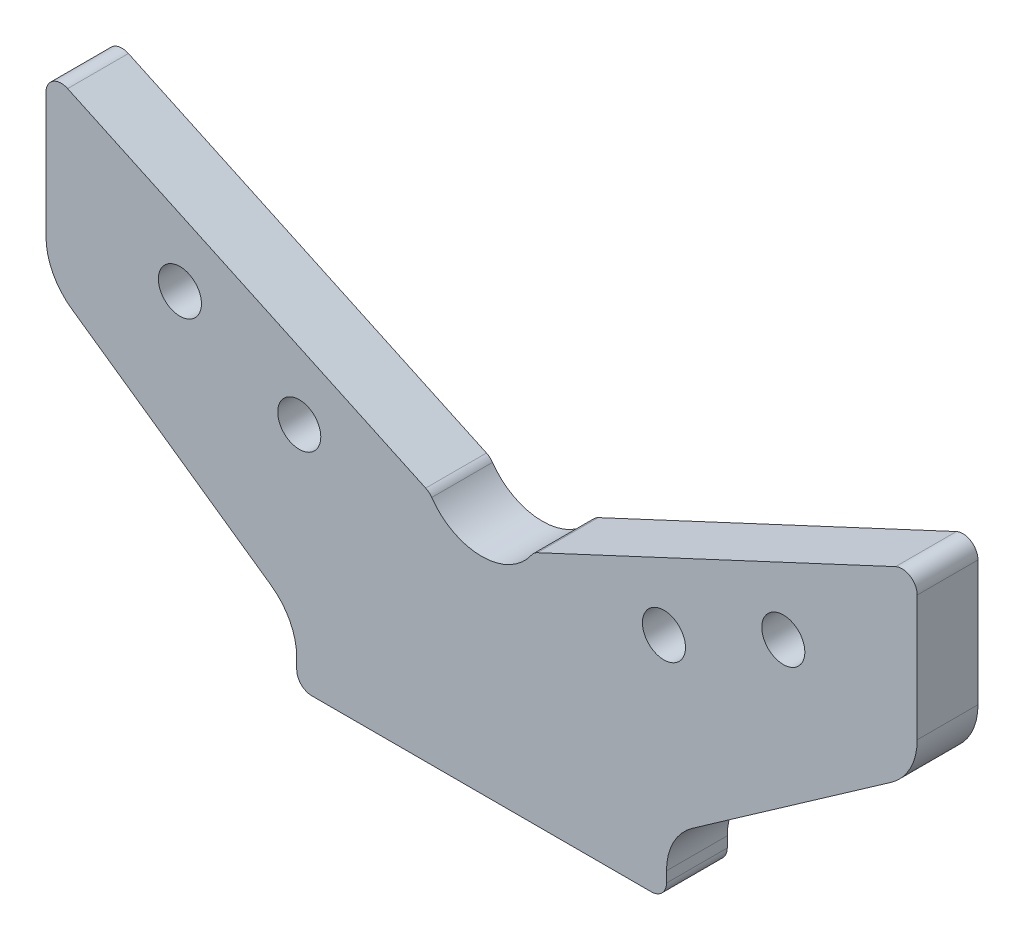
ISO-10303-21;
HEADER;
FILE_DESCRIPTION(('STEP AP214'),'2;1');
FILE_NAME('part.step','',(''),(''),'','','');
FILE_SCHEMA(('AUTOMOTIVE_DESIGN { 1 0 10303 214 1 1 1 1 }'));
ENDSEC;
DATA;
#1=APPLICATION_CONTEXT('core data for automotive mechanical design processes');
#2=APPLICATION_PROTOCOL_DEFINITION('international standard','automotive_design',2000,#1);
#3=PRODUCT_CONTEXT('',#1,'mechanical');
#4=PRODUCT('Part','Part','',(#3));
#5=PRODUCT_RELATED_PRODUCT_CATEGORY('part','',(#4));
#6=PRODUCT_DEFINITION_FORMATION('','',#4);
#7=PRODUCT_DEFINITION_CONTEXT('part definition',#1,'design');
#8=PRODUCT_DEFINITION('design','',#6,#7);
#9=PRODUCT_DEFINITION_SHAPE('','',#8);
#10=(LENGTH_UNIT() NAMED_UNIT(*) SI_UNIT(.MILLI.,.METRE.));
#11=(NAMED_UNIT(*) PLANE_ANGLE_UNIT() SI_UNIT($,.RADIAN.));
#12=(NAMED_UNIT(*) SI_UNIT($,.STERADIAN.) SOLID_ANGLE_UNIT());
#13=UNCERTAINTY_MEASURE_WITH_UNIT(LENGTH_MEASURE(1.E-05),#10,'distance_accuracy_value','');
#14=(GEOMETRIC_REPRESENTATION_CONTEXT(3) GLOBAL_UNCERTAINTY_ASSIGNED_CONTEXT((#13)) GLOBAL_UNIT_ASSIGNED_CONTEXT((#10,
#11,#12)) REPRESENTATION_CONTEXT('',''));
#15=CARTESIAN_POINT('',(0.,0.,0.));
#16=DIRECTION('',(0.,0.,1.));
#17=DIRECTION('',(1.,0.,0.));
#18=AXIS2_PLACEMENT_3D('',#15,#16,#17);
#19=CARTESIAN_POINT('',(48.5,5.09292225199856,12.));
#20=DIRECTION('',(0.,0.,-1.));
#21=DIRECTION('',(-1.,0.,0.));
#22=AXIS2_PLACEMENT_3D('',#19,#20,#21);
#23=CYLINDRICAL_SURFACE('',#22,12.);
#24=CARTESIAN_POINT('',(48.5,5.09292225199856,0.));
#25=DIRECTION('',(0.,0.,-1.));
#26=DIRECTION('',(1.,0.,0.));
#27=AXIS2_PLACEMENT_3D('',#24,#25,#26);
#28=CIRCLE('',#27,12.);
#29=CARTESIAN_POINT('',(36.5,5.09292225199856,0.));
#30=VERTEX_POINT('',#29);
#31=CARTESIAN_POINT('',(41.6170827637875,14.9227467834665,0.));
#32=VERTEX_POINT('',#31);
#33=EDGE_CURVE('E214',#30,#32,#28,.T.);
#34=ORIENTED_EDGE('',*,*,#33,.T.);
#35=DIRECTION('',(0.,0.,-1.));
#36=VECTOR('',#35,1.);
#37=CARTESIAN_POINT('',(41.6170827637875,14.9227467834665,12.));
#38=LINE('',#37,#36);
#39=CARTESIAN_POINT('',(41.6170827637875,14.9227467834665,12.));
#40=VERTEX_POINT('',#39);
#41=EDGE_CURVE('E11',#40,#32,#38,.T.);
#42=ORIENTED_EDGE('',*,*,#41,.F.);
#43=CARTESIAN_POINT('',(48.5,5.09292225199856,12.));
#44=DIRECTION('',(0.,0.,-1.));
#45=DIRECTION('',(1.,0.,0.));
#46=AXIS2_PLACEMENT_3D('',#43,#44,#45);
#47=CIRCLE('',#46,12.);
#48=CARTESIAN_POINT('',(36.5,5.09292225199856,12.));
#49=VERTEX_POINT('',#48);
#50=EDGE_CURVE('E254',#49,#40,#47,.T.);
#51=ORIENTED_EDGE('',*,*,#50,.F.);
#52=DIRECTION('',(0.,0.,-1.));
#53=VECTOR('',#52,1.);
#54=CARTESIAN_POINT('',(36.5,5.09292225199856,12.));
#55=LINE('',#54,#53);
#56=EDGE_CURVE('E210',#49,#30,#55,.T.);
#57=ORIENTED_EDGE('',*,*,#56,.T.);
#58=EDGE_LOOP('',(#34,#42,#51,#57));
#59=FACE_BOUND('',#58,.T.);
#60=ADVANCED_FACE('F45',(#59),#23,.F.);
#61=CARTESIAN_POINT('',(41.6170827637875,14.9227467834665,12.));
#62=DIRECTION('',(-0.573576436351044,0.819152044288993,0.));
#63=DIRECTION('',(-0.819152044288993,-0.573576436351044,0.));
#64=AXIS2_PLACEMENT_3D('',#61,#62,#63);
#65=PLANE('',#64);
#66=DIRECTION('',(0.819152044288993,0.573576436351044,0.));
#67=VECTOR('',#66,1.);
#68=CARTESIAN_POINT('',(41.6170827637875,14.9227467834665,0.));
#69=LINE('',#68,#67);
#70=CARTESIAN_POINT('',(80.8829172362125,42.4169800751531,0.));
#71=VERTEX_POINT('',#70);
#72=EDGE_CURVE('E217',#32,#71,#69,.T.);
#73=ORIENTED_EDGE('',*,*,#72,.T.);
#74=DIRECTION('',(0.,0.,-1.));
#75=VECTOR('',#74,1.);
#76=CARTESIAN_POINT('',(80.8829172362125,42.4169800751531,12.));
#77=LINE('',#76,#75);
#78=CARTESIAN_POINT('',(80.8829172362125,42.4169800751531,12.));
#79=VERTEX_POINT('',#78);
#80=EDGE_CURVE('E54',#79,#71,#77,.T.);
#81=ORIENTED_EDGE('',*,*,#80,.F.);
#82=DIRECTION('',(0.819152044288993,0.573576436351044,0.));
#83=VECTOR('',#82,1.);
#84=CARTESIAN_POINT('',(41.6170827637875,14.9227467834665,12.));
#85=LINE('',#84,#83);
#86=EDGE_CURVE('E142',#40,#79,#85,.T.);
#87=ORIENTED_EDGE('',*,*,#86,.F.);
#88=ORIENTED_EDGE('',*,*,#41,.T.);
#89=EDGE_LOOP('',(#73,#81,#87,#88));
#90=FACE_BOUND('',#89,.T.);
#91=ADVANCED_FACE('F384',(#90),#65,.F.);
#92=CARTESIAN_POINT('',(74.,52.246804606621,12.));
#93=DIRECTION('',(0.,0.,-1.));
#94=DIRECTION('',(-1.,0.,0.));
#95=AXIS2_PLACEMENT_3D('',#92,#93,#94);
#96=CYLINDRICAL_SURFACE('',#95,12.);
#97=CARTESIAN_POINT('',(74.,52.246804606621,0.));
#98=DIRECTION('',(0.,0.,1.));
#99=DIRECTION('',(1.,0.,0.));
#100=AXIS2_PLACEMENT_3D('',#97,#98,#99);
#101=CIRCLE('',#100,12.);
#102=CARTESIAN_POINT('',(86.,52.246804606621,0.));
#103=VERTEX_POINT('',#102);
#104=EDGE_CURVE('E220',#71,#103,#101,.T.);
#105=ORIENTED_EDGE('',*,*,#104,.T.);
#106=DIRECTION('',(0.,0.,-1.));
#107=VECTOR('',#106,1.);
#108=CARTESIAN_POINT('',(86.,52.246804606621,12.));
#109=LINE('',#108,#107);
#110=CARTESIAN_POINT('',(86.,52.246804606621,12.));
#111=VERTEX_POINT('',#110);
#112=EDGE_CURVE('E297',#111,#103,#109,.T.);
#113=ORIENTED_EDGE('',*,*,#112,.F.);
#114=CARTESIAN_POINT('',(74.,52.246804606621,12.));
#115=DIRECTION('',(0.,0.,1.));
#116=DIRECTION('',(1.,0.,0.));
#117=AXIS2_PLACEMENT_3D('',#114,#115,#116);
#118=CIRCLE('',#117,12.);
#119=EDGE_CURVE('E327',#79,#111,#118,.T.);
#120=ORIENTED_EDGE('',*,*,#119,.F.);
#121=ORIENTED_EDGE('',*,*,#80,.T.);
#122=EDGE_LOOP('',(#105,#113,#120,#121));
#123=FACE_BOUND('',#122,.T.);
#124=ADVANCED_FACE('F388',(#123),#96,.T.);
#125=CARTESIAN_POINT('',(86.,52.246804606621,12.));
#126=DIRECTION('',(-1.,0.,0.));
#127=DIRECTION('',(0.,0.,1.));
#128=AXIS2_PLACEMENT_3D('',#125,#126,#127);
#129=PLANE('',#128);
#130=DIRECTION('',(0.,1.,0.));
#131=VECTOR('',#130,1.);
#132=CARTESIAN_POINT('',(86.,52.246804606621,0.));
#133=LINE('',#132,#131);
#134=CARTESIAN_POINT('',(86.,77.,0.));
#135=VERTEX_POINT('',#134);
#136=EDGE_CURVE('E222',#103,#135,#133,.T.);
#137=ORIENTED_EDGE('',*,*,#136,.T.);
#138=DIRECTION('',(0.,0.,-1.));
#139=VECTOR('',#138,1.);
#140=CARTESIAN_POINT('',(86.,77.,12.));
#141=LINE('',#140,#139);
#142=CARTESIAN_POINT('',(86.,77.,12.));
#143=VERTEX_POINT('',#142);
#144=EDGE_CURVE('E294',#143,#135,#141,.T.);
#145=ORIENTED_EDGE('',*,*,#144,.F.);
#146=DIRECTION('',(0.,1.,0.));
#147=VECTOR('',#146,1.);
#148=CARTESIAN_POINT('',(86.,52.246804606621,12.));
#149=LINE('',#148,#147);
#150=EDGE_CURVE('E329',#111,#143,#149,.T.);
#151=ORIENTED_EDGE('',*,*,#150,.F.);
#152=ORIENTED_EDGE('',*,*,#112,.T.);
#153=EDGE_LOOP('',(#137,#145,#151,#152));
#154=FACE_BOUND('',#153,.T.);
#155=ADVANCED_FACE('F392',(#154),#129,.F.);
#156=CARTESIAN_POINT('',(83.,77.,12.));
#157=DIRECTION('',(0.,0.,-1.));
#158=DIRECTION('',(-1.,0.,0.));
#159=AXIS2_PLACEMENT_3D('',#156,#157,#158);
#160=CYLINDRICAL_SURFACE('',#159,3.);
#161=CARTESIAN_POINT('',(83.,77.,0.));
#162=DIRECTION('',(0.,0.,1.));
#163=DIRECTION('',(-1.,0.,0.));
#164=AXIS2_PLACEMENT_3D('',#161,#162,#163);
#165=CIRCLE('',#164,3.);
#166=CARTESIAN_POINT('',(81.7321452147779,79.7189233611099,0.));
#167=VERTEX_POINT('',#166);
#168=EDGE_CURVE('E224',#135,#167,#165,.T.);
#169=ORIENTED_EDGE('',*,*,#168,.T.);
#170=DIRECTION('',(0.,0.,-1.));
#171=VECTOR('',#170,1.);
#172=CARTESIAN_POINT('',(81.7321452147779,79.7189233611099,12.));
#173=LINE('',#172,#171);
#174=CARTESIAN_POINT('',(81.7321452147779,79.7189233611099,12.));
#175=VERTEX_POINT('',#174);
#176=EDGE_CURVE('E291',#175,#167,#173,.T.);
#177=ORIENTED_EDGE('',*,*,#176,.F.);
#178=CARTESIAN_POINT('',(83.,77.,12.));
#179=DIRECTION('',(0.,0.,1.));
#180=DIRECTION('',(-1.,0.,0.));
#181=AXIS2_PLACEMENT_3D('',#178,#179,#180);
#182=CIRCLE('',#181,3.);
#183=EDGE_CURVE('E331',#143,#175,#182,.T.);
#184=ORIENTED_EDGE('',*,*,#183,.F.);
#185=ORIENTED_EDGE('',*,*,#144,.T.);
#186=EDGE_LOOP('',(#169,#177,#184,#185));
#187=FACE_BOUND('',#186,.T.);
#188=ADVANCED_FACE('F398',(#187),#160,.T.);
#189=CARTESIAN_POINT('',(81.7321452147779,79.7189233611099,12.));
#190=DIRECTION('',(0.422618261740705,-0.906307787036647,0.));
#191=DIRECTION('',(0.906307787036647,0.422618261740706,0.));
#192=AXIS2_PLACEMENT_3D('',#189,#190,#191);
#193=PLANE('',#192);
#194=DIRECTION('',(-0.906307787036647,-0.422618261740706,0.));
#195=VECTOR('',#194,1.);
#196=CARTESIAN_POINT('',(81.7321452147779,79.7189233611099,0.));
#197=LINE('',#196,#195);
#198=CARTESIAN_POINT('',(11.0434047899439,46.7562223556785,0.));
#199=VERTEX_POINT('',#198);
#200=EDGE_CURVE('E226',#167,#199,#197,.T.);
#201=ORIENTED_EDGE('',*,*,#200,.T.);
#202=DIRECTION('',(0.,0.,-1.));
#203=VECTOR('',#202,1.);
#204=CARTESIAN_POINT('',(11.0434047899439,46.7562223556785,12.));
#205=LINE('',#204,#203);
#206=CARTESIAN_POINT('',(11.0434047899439,46.7562223556785,12.));
#207=VERTEX_POINT('',#206);
#208=EDGE_CURVE('E288',#207,#199,#205,.T.);
#209=ORIENTED_EDGE('',*,*,#208,.F.);
#210=DIRECTION('',(-0.906307787036647,-0.422618261740706,0.));
#211=VECTOR('',#210,1.);
#212=CARTESIAN_POINT('',(81.7321452147779,79.7189233611099,12.));
#213=LINE('',#212,#211);
#214=EDGE_CURVE('E333',#175,#207,#213,.T.);
#215=ORIENTED_EDGE('',*,*,#214,.F.);
#216=ORIENTED_EDGE('',*,*,#176,.T.);
#217=EDGE_LOOP('',(#201,#209,#215,#216));
#218=FACE_BOUND('',#217,.T.);
#219=ADVANCED_FACE('F402',(#218),#193,.F.);
#220=CARTESIAN_POINT('',(12.311259575166,44.0372989945685,12.));
#221=DIRECTION('',(0.,0.,-1.));
#222=DIRECTION('',(-1.,0.,0.));
#223=AXIS2_PLACEMENT_3D('',#220,#221,#222);
#224=CYLINDRICAL_SURFACE('',#223,3.00000000000001);
#225=CARTESIAN_POINT('',(12.311259575166,44.0372989945685,0.));
#226=DIRECTION('',(0.,0.,1.));
#227=DIRECTION('',(-1.,0.,0.));
#228=AXIS2_PLACEMENT_3D('',#225,#226,#227);
#229=CIRCLE('',#228,3.00000000000001);
#230=CARTESIAN_POINT('',(9.84900766013283,45.7511588216592,0.));
#231=VERTEX_POINT('',#230);
#232=EDGE_CURVE('E228',#199,#231,#229,.T.);
#233=ORIENTED_EDGE('',*,*,#232,.T.);
#234=DIRECTION('',(0.,0.,-1.));
#235=VECTOR('',#234,1.);
#236=CARTESIAN_POINT('',(9.84900766013283,45.7511588216592,12.));
#237=LINE('',#236,#235);
#238=CARTESIAN_POINT('',(9.84900766013283,45.7511588216592,12.));
#239=VERTEX_POINT('',#238);
#240=EDGE_CURVE('E285',#239,#231,#237,.T.);
#241=ORIENTED_EDGE('',*,*,#240,.F.);
#242=CARTESIAN_POINT('',(12.311259575166,44.0372989945685,12.));
#243=DIRECTION('',(0.,0.,1.));
#244=DIRECTION('',(-1.,0.,0.));
#245=AXIS2_PLACEMENT_3D('',#242,#243,#244);
#246=CIRCLE('',#245,3.00000000000001);
#247=EDGE_CURVE('E335',#207,#239,#246,.T.);
#248=ORIENTED_EDGE('',*,*,#247,.F.);
#249=ORIENTED_EDGE('',*,*,#208,.T.);
#250=EDGE_LOOP('',(#233,#241,#248,#249));
#251=FACE_BOUND('',#250,.T.);
#252=ADVANCED_FACE('F406',(#251),#224,.T.);
#253=CARTESIAN_POINT('',(0.,52.6065981300219,12.));
#254=DIRECTION('',(0.,0.,-1.));
#255=DIRECTION('',(-1.,0.,0.));
#256=AXIS2_PLACEMENT_3D('',#253,#254,#255);
#257=CYLINDRICAL_SURFACE('',#256,12.);
#258=CARTESIAN_POINT('',(0.,52.6065981300219,0.));
#259=DIRECTION('',(0.,0.,-1.));
#260=DIRECTION('',(1.,0.,0.));
#261=AXIS2_PLACEMENT_3D('',#258,#259,#260);
#262=CIRCLE('',#261,12.);
#263=CARTESIAN_POINT('',(-9.84900766013284,45.7511588216592,0.));
#264=VERTEX_POINT('',#263);
#265=EDGE_CURVE('E230',#231,#264,#262,.T.);
#266=ORIENTED_EDGE('',*,*,#265,.T.);
#267=DIRECTION('',(0.,0.,-1.));
#268=VECTOR('',#267,1.);
#269=CARTESIAN_POINT('',(-9.84900766013284,45.7511588216592,12.));
#270=LINE('',#269,#268);
#271=CARTESIAN_POINT('',(-9.84900766013284,45.7511588216592,12.));
#272=VERTEX_POINT('',#271);
#273=EDGE_CURVE('E282',#272,#264,#270,.T.);
#274=ORIENTED_EDGE('',*,*,#273,.F.);
#275=CARTESIAN_POINT('',(0.,52.6065981300219,12.));
#276=DIRECTION('',(0.,0.,-1.));
#277=DIRECTION('',(1.,0.,0.));
#278=AXIS2_PLACEMENT_3D('',#275,#276,#277);
#279=CIRCLE('',#278,12.);
#280=EDGE_CURVE('E337',#239,#272,#279,.T.);
#281=ORIENTED_EDGE('',*,*,#280,.F.);
#282=ORIENTED_EDGE('',*,*,#240,.T.);
#283=EDGE_LOOP('',(#266,#274,#281,#282));
#284=FACE_BOUND('',#283,.T.);
#285=ADVANCED_FACE('F410',(#284),#257,.F.);
#286=CARTESIAN_POINT('',(-12.311259575166,44.0372989945685,12.));
#287=DIRECTION('',(0.,0.,-1.));
#288=DIRECTION('',(-1.,0.,0.));
#289=AXIS2_PLACEMENT_3D('',#286,#287,#288);
#290=CYLINDRICAL_SURFACE('',#289,3.00000000000001);
#291=CARTESIAN_POINT('',(-12.311259575166,44.0372989945685,0.));
#292=DIRECTION('',(0.,0.,1.));
#293=DIRECTION('',(1.,0.,0.));
#294=AXIS2_PLACEMENT_3D('',#291,#292,#293);
#295=CIRCLE('',#294,3.00000000000001);
#296=CARTESIAN_POINT('',(-11.0434047899439,46.7562223556785,0.));
#297=VERTEX_POINT('',#296);
#298=EDGE_CURVE('E232',#264,#297,#295,.T.);
#299=ORIENTED_EDGE('',*,*,#298,.T.);
#300=DIRECTION('',(0.,0.,-1.));
#301=VECTOR('',#300,1.);
#302=CARTESIAN_POINT('',(-11.0434047899439,46.7562223556785,12.));
#303=LINE('',#302,#301);
#304=CARTESIAN_POINT('',(-11.0434047899439,46.7562223556785,12.));
#305=VERTEX_POINT('',#304);
#306=EDGE_CURVE('E279',#305,#297,#303,.T.);
#307=ORIENTED_EDGE('',*,*,#306,.F.);
#308=CARTESIAN_POINT('',(-12.311259575166,44.0372989945685,12.));
#309=DIRECTION('',(0.,0.,1.));
#310=DIRECTION('',(1.,0.,0.));
#311=AXIS2_PLACEMENT_3D('',#308,#309,#310);
#312=CIRCLE('',#311,3.00000000000001);
#313=EDGE_CURVE('E339',#272,#305,#312,.T.);
#314=ORIENTED_EDGE('',*,*,#313,.F.);
#315=ORIENTED_EDGE('',*,*,#273,.T.);
#316=EDGE_LOOP('',(#299,#307,#314,#315));
#317=FACE_BOUND('',#316,.T.);
#318=ADVANCED_FACE('F414',(#317),#290,.T.);
#319=CARTESIAN_POINT('',(-81.7321452147779,79.7189233611099,12.));
#320=DIRECTION('',(-0.422618261740705,-0.906307787036647,0.));
#321=DIRECTION('',(0.906307787036647,-0.422618261740706,0.));
#322=AXIS2_PLACEMENT_3D('',#319,#320,#321);
#323=PLANE('',#322);
#324=DIRECTION('',(-0.906307787036647,0.422618261740706,0.));
#325=VECTOR('',#324,1.);
#326=CARTESIAN_POINT('',(-81.7321452147779,79.7189233611099,0.));
#327=LINE('',#326,#325);
#328=CARTESIAN_POINT('',(-81.7321452147779,79.7189233611099,0.));
#329=VERTEX_POINT('',#328);
#330=EDGE_CURVE('E234',#297,#329,#327,.T.);
#331=ORIENTED_EDGE('',*,*,#330,.T.);
#332=DIRECTION('',(0.,0.,-1.));
#333=VECTOR('',#332,1.);
#334=CARTESIAN_POINT('',(-81.7321452147779,79.7189233611099,12.));
#335=LINE('',#334,#333);
#336=CARTESIAN_POINT('',(-81.7321452147779,79.7189233611099,12.));
#337=VERTEX_POINT('',#336);
#338=EDGE_CURVE('E276',#337,#329,#335,.T.);
#339=ORIENTED_EDGE('',*,*,#338,.F.);
#340=DIRECTION('',(-0.906307787036647,0.422618261740706,0.));
#341=VECTOR('',#340,1.);
#342=CARTESIAN_POINT('',(-81.7321452147779,79.7189233611099,12.));
#343=LINE('',#342,#341);
#344=EDGE_CURVE('E341',#305,#337,#343,.T.);
#345=ORIENTED_EDGE('',*,*,#344,.F.);
#346=ORIENTED_EDGE('',*,*,#306,.T.);
#347=EDGE_LOOP('',(#331,#339,#345,#346));
#348=FACE_BOUND('',#347,.T.);
#349=ADVANCED_FACE('F418',(#348),#323,.F.);
#350=CARTESIAN_POINT('',(-83.,77.,12.));
#351=DIRECTION('',(0.,0.,-1.));
#352=DIRECTION('',(-1.,0.,0.));
#353=AXIS2_PLACEMENT_3D('',#350,#351,#352);
#354=CYLINDRICAL_SURFACE('',#353,3.);
#355=CARTESIAN_POINT('',(-83.,77.,0.));
#356=DIRECTION('',(0.,0.,1.));
#357=DIRECTION('',(-1.,0.,0.));
#358=AXIS2_PLACEMENT_3D('',#355,#356,#357);
#359=CIRCLE('',#358,3.);
#360=CARTESIAN_POINT('',(-86.,77.,0.));
#361=VERTEX_POINT('',#360);
#362=EDGE_CURVE('E236',#329,#361,#359,.T.);
#363=ORIENTED_EDGE('',*,*,#362,.T.);
#364=DIRECTION('',(0.,0.,-1.));
#365=VECTOR('',#364,1.);
#366=CARTESIAN_POINT('',(-86.,77.,12.));
#367=LINE('',#366,#365);
#368=CARTESIAN_POINT('',(-86.,77.,12.));
#369=VERTEX_POINT('',#368);
#370=EDGE_CURVE('E273',#369,#361,#367,.T.);
#371=ORIENTED_EDGE('',*,*,#370,.F.);
#372=CARTESIAN_POINT('',(-83.,77.,12.));
#373=DIRECTION('',(0.,0.,1.));
#374=DIRECTION('',(-1.,0.,0.));
#375=AXIS2_PLACEMENT_3D('',#372,#373,#374);
#376=CIRCLE('',#375,3.);
#377=EDGE_CURVE('E343',#337,#369,#376,.T.);
#378=ORIENTED_EDGE('',*,*,#377,.F.);
#379=ORIENTED_EDGE('',*,*,#338,.T.);
#380=EDGE_LOOP('',(#363,#371,#378,#379));
#381=FACE_BOUND('',#380,.T.);
#382=ADVANCED_FACE('F422',(#381),#354,.T.);
#383=CARTESIAN_POINT('',(-86.,52.246804606621,12.));
#384=DIRECTION('',(1.,0.,0.));
#385=DIRECTION('',(0.,0.,-1.));
#386=AXIS2_PLACEMENT_3D('',#383,#384,#385);
#387=PLANE('',#386);
#388=DIRECTION('',(0.,-1.,0.));
#389=VECTOR('',#388,1.);
#390=CARTESIAN_POINT('',(-86.,52.246804606621,0.));
#391=LINE('',#390,#389);
#392=CARTESIAN_POINT('',(-86.,52.246804606621,0.));
#393=VERTEX_POINT('',#392);
#394=EDGE_CURVE('E238',#361,#393,#391,.T.);
#395=ORIENTED_EDGE('',*,*,#394,.T.);
#396=DIRECTION('',(0.,0.,-1.));
#397=VECTOR('',#396,1.);
#398=CARTESIAN_POINT('',(-86.,52.246804606621,12.));
#399=LINE('',#398,#397);
#400=CARTESIAN_POINT('',(-86.,52.246804606621,12.));
#401=VERTEX_POINT('',#400);
#402=EDGE_CURVE('E270',#401,#393,#399,.T.);
#403=ORIENTED_EDGE('',*,*,#402,.F.);
#404=DIRECTION('',(0.,-1.,0.));
#405=VECTOR('',#404,1.);
#406=CARTESIAN_POINT('',(-86.,52.246804606621,12.));
#407=LINE('',#406,#405);
#408=EDGE_CURVE('E345',#369,#401,#407,.T.);
#409=ORIENTED_EDGE('',*,*,#408,.F.);
#410=ORIENTED_EDGE('',*,*,#370,.T.);
#411=EDGE_LOOP('',(#395,#403,#409,#410));
#412=FACE_BOUND('',#411,.T.);
#413=ADVANCED_FACE('F426',(#412),#387,.F.);
#414=CARTESIAN_POINT('',(-74.,52.246804606621,12.));
#415=DIRECTION('',(0.,0.,-1.));
#416=DIRECTION('',(-1.,0.,0.));
#417=AXIS2_PLACEMENT_3D('',#414,#415,#416);
#418=CYLINDRICAL_SURFACE('',#417,12.);
#419=CARTESIAN_POINT('',(-74.,52.246804606621,0.));
#420=DIRECTION('',(0.,0.,1.));
#421=DIRECTION('',(-1.,0.,0.));
#422=AXIS2_PLACEMENT_3D('',#419,#420,#421);
#423=CIRCLE('',#422,12.);
#424=CARTESIAN_POINT('',(-80.8829172362125,42.4169800751531,0.));
#425=VERTEX_POINT('',#424);
#426=EDGE_CURVE('E240',#393,#425,#423,.T.);
#427=ORIENTED_EDGE('',*,*,#426,.T.);
#428=DIRECTION('',(0.,0.,-1.));
#429=VECTOR('',#428,1.);
#430=CARTESIAN_POINT('',(-80.8829172362125,42.4169800751531,12.));
#431=LINE('',#430,#429);
#432=CARTESIAN_POINT('',(-80.8829172362125,42.4169800751531,12.));
#433=VERTEX_POINT('',#432);
#434=EDGE_CURVE('E267',#433,#425,#431,.T.);
#435=ORIENTED_EDGE('',*,*,#434,.F.);
#436=CARTESIAN_POINT('',(-74.,52.246804606621,12.));
#437=DIRECTION('',(0.,0.,1.));
#438=DIRECTION('',(-1.,0.,0.));
#439=AXIS2_PLACEMENT_3D('',#436,#437,#438);
#440=CIRCLE('',#439,12.);
#441=EDGE_CURVE('E347',#401,#433,#440,.T.);
#442=ORIENTED_EDGE('',*,*,#441,.F.);
#443=ORIENTED_EDGE('',*,*,#402,.T.);
#444=EDGE_LOOP('',(#427,#435,#442,#443));
#445=FACE_BOUND('',#444,.T.);
#446=ADVANCED_FACE('F430',(#445),#418,.T.);
#447=CARTESIAN_POINT('',(-41.6170827637875,14.9227467834665,12.));
#448=DIRECTION('',(0.573576436351044,0.819152044288993,0.));
#449=DIRECTION('',(-0.819152044288993,0.573576436351044,0.));
#450=AXIS2_PLACEMENT_3D('',#447,#448,#449);
#451=PLANE('',#450);
#452=DIRECTION('',(0.819152044288993,-0.573576436351044,0.));
#453=VECTOR('',#452,1.);
#454=CARTESIAN_POINT('',(-41.6170827637875,14.9227467834665,0.));
#455=LINE('',#454,#453);
#456=CARTESIAN_POINT('',(-41.6170827637875,14.9227467834665,0.));
#457=VERTEX_POINT('',#456);
#458=EDGE_CURVE('E242',#425,#457,#455,.T.);
#459=ORIENTED_EDGE('',*,*,#458,.T.);
#460=DIRECTION('',(0.,0.,-1.));
#461=VECTOR('',#460,1.);
#462=CARTESIAN_POINT('',(-41.6170827637875,14.9227467834665,12.));
#463=LINE('',#462,#461);
#464=CARTESIAN_POINT('',(-41.6170827637875,14.9227467834665,12.));
#465=VERTEX_POINT('',#464);
#466=EDGE_CURVE('E264',#465,#457,#463,.T.);
#467=ORIENTED_EDGE('',*,*,#466,.F.);
#468=DIRECTION('',(0.819152044288993,-0.573576436351044,0.));
#469=VECTOR('',#468,1.);
#470=CARTESIAN_POINT('',(-41.6170827637875,14.9227467834665,12.));
#471=LINE('',#470,#469);
#472=EDGE_CURVE('E349',#433,#465,#471,.T.);
#473=ORIENTED_EDGE('',*,*,#472,.F.);
#474=ORIENTED_EDGE('',*,*,#434,.T.);
#475=EDGE_LOOP('',(#459,#467,#473,#474));
#476=FACE_BOUND('',#475,.T.);
#477=ADVANCED_FACE('F434',(#476),#451,.F.);
#478=CARTESIAN_POINT('',(-48.5,5.09292225199856,12.));
#479=DIRECTION('',(0.,0.,-1.));
#480=DIRECTION('',(-1.,0.,0.));
#481=AXIS2_PLACEMENT_3D('',#478,#479,#480);
#482=CYLINDRICAL_SURFACE('',#481,12.);
#483=CARTESIAN_POINT('',(-48.5,5.09292225199856,0.));
#484=DIRECTION('',(0.,0.,-1.));
#485=DIRECTION('',(1.,0.,0.));
#486=AXIS2_PLACEMENT_3D('',#483,#484,#485);
#487=CIRCLE('',#486,12.);
#488=CARTESIAN_POINT('',(-36.5,5.09292225199856,0.));
#489=VERTEX_POINT('',#488);
#490=EDGE_CURVE('E244',#457,#489,#487,.T.);
#491=ORIENTED_EDGE('',*,*,#490,.T.);
#492=DIRECTION('',(0.,0.,-1.));
#493=VECTOR('',#492,1.);
#494=CARTESIAN_POINT('',(-36.5,5.09292225199856,12.));
#495=LINE('',#494,#493);
#496=CARTESIAN_POINT('',(-36.5,5.09292225199856,12.));
#497=VERTEX_POINT('',#496);
#498=EDGE_CURVE('E261',#497,#489,#495,.T.);
#499=ORIENTED_EDGE('',*,*,#498,.F.);
#500=CARTESIAN_POINT('',(-48.5,5.09292225199856,12.));
#501=DIRECTION('',(0.,0.,-1.));
#502=DIRECTION('',(1.,0.,0.));
#503=AXIS2_PLACEMENT_3D('',#500,#501,#502);
#504=CIRCLE('',#503,12.);
#505=EDGE_CURVE('E351',#465,#497,#504,.T.);
#506=ORIENTED_EDGE('',*,*,#505,.F.);
#507=ORIENTED_EDGE('',*,*,#466,.T.);
#508=EDGE_LOOP('',(#491,#499,#506,#507));
#509=FACE_BOUND('',#508,.T.);
#510=ADVANCED_FACE('F438',(#509),#482,.F.);
#511=CARTESIAN_POINT('',(-36.5,3.00000000000002,12.));
#512=DIRECTION('',(1.,0.,0.));
#513=DIRECTION('',(0.,1.,0.));
#514=AXIS2_PLACEMENT_3D('',#511,#512,#513);
#515=PLANE('',#514);
#516=DIRECTION('',(0.,-1.,0.));
#517=VECTOR('',#516,1.);
#518=CARTESIAN_POINT('',(-36.5,3.00000000000002,0.));
#519=LINE('',#518,#517);
#520=CARTESIAN_POINT('',(-36.5,3.00000000000002,0.));
#521=VERTEX_POINT('',#520);
#522=EDGE_CURVE('E246',#489,#521,#519,.T.);
#523=ORIENTED_EDGE('',*,*,#522,.T.);
#524=DIRECTION('',(0.,0.,-1.));
#525=VECTOR('',#524,1.);
#526=CARTESIAN_POINT('',(-36.5,3.00000000000002,12.));
#527=LINE('',#526,#525);
#528=CARTESIAN_POINT('',(-36.5,3.00000000000002,12.));
#529=VERTEX_POINT('',#528);
#530=EDGE_CURVE('E258',#529,#521,#527,.T.);
#531=ORIENTED_EDGE('',*,*,#530,.F.);
#532=DIRECTION('',(0.,-1.,0.));
#533=VECTOR('',#532,1.);
#534=CARTESIAN_POINT('',(-36.5,3.00000000000002,12.));
#535=LINE('',#534,#533);
#536=EDGE_CURVE('E353',#497,#529,#535,.T.);
#537=ORIENTED_EDGE('',*,*,#536,.F.);
#538=ORIENTED_EDGE('',*,*,#498,.T.);
#539=EDGE_LOOP('',(#523,#531,#537,#538));
#540=FACE_BOUND('',#539,.T.);
#541=ADVANCED_FACE('F359',(#540),#515,.F.);
#542=CARTESIAN_POINT('',(-33.5,3.,12.));
#543=DIRECTION('',(0.,0.,-1.));
#544=DIRECTION('',(-1.,0.,0.));
#545=AXIS2_PLACEMENT_3D('',#542,#543,#544);
#546=CYLINDRICAL_SURFACE('',#545,3.);
#547=CARTESIAN_POINT('',(-33.5,3.,0.));
#548=DIRECTION('',(0.,0.,1.));
#549=DIRECTION('',(1.,0.,0.));
#550=AXIS2_PLACEMENT_3D('',#547,#548,#549);
#551=CIRCLE('',#550,3.);
#552=CARTESIAN_POINT('',(-33.5,0.,0.));
#553=VERTEX_POINT('',#552);
#554=EDGE_CURVE('E248',#521,#553,#551,.T.);
#555=ORIENTED_EDGE('',*,*,#554,.T.);
#556=DIRECTION('',(0.,0.,-1.));
#557=VECTOR('',#556,1.);
#558=CARTESIAN_POINT('',(-33.5,0.,12.));
#559=LINE('',#558,#557);
#560=CARTESIAN_POINT('',(-33.5,0.,12.));
#561=VERTEX_POINT('',#560);
#562=EDGE_CURVE('E205',#561,#553,#559,.T.);
#563=ORIENTED_EDGE('',*,*,#562,.F.);
#564=CARTESIAN_POINT('',(-33.5,3.,12.));
#565=DIRECTION('',(0.,0.,1.));
#566=DIRECTION('',(1.,0.,0.));
#567=AXIS2_PLACEMENT_3D('',#564,#565,#566);
#568=CIRCLE('',#567,3.);
#569=EDGE_CURVE('E197',#529,#561,#568,.T.);
#570=ORIENTED_EDGE('',*,*,#569,.F.);
#571=ORIENTED_EDGE('',*,*,#530,.T.);
#572=EDGE_LOOP('',(#555,#563,#570,#571));
#573=FACE_BOUND('',#572,.T.);
#574=ADVANCED_FACE('F363',(#573),#546,.T.);
#575=CARTESIAN_POINT('',(0.,0.,12.));
#576=DIRECTION('',(0.,1.,0.));
#577=DIRECTION('',(-1.,0.,0.));
#578=AXIS2_PLACEMENT_3D('',#575,#576,#577);
#579=PLANE('',#578);
#580=DIRECTION('',(1.,0.,0.));
#581=VECTOR('',#580,1.);
#582=CARTESIAN_POINT('',(0.,0.,0.));
#583=LINE('',#582,#581);
#584=CARTESIAN_POINT('',(33.5,0.,0.));
#585=VERTEX_POINT('',#584);
#586=EDGE_CURVE('E204',#553,#585,#583,.T.);
#587=ORIENTED_EDGE('',*,*,#586,.T.);
#588=DIRECTION('',(0.,0.,-1.));
#589=VECTOR('',#588,1.);
#590=CARTESIAN_POINT('',(33.5,0.,12.));
#591=LINE('',#590,#589);
#592=CARTESIAN_POINT('',(33.5,0.,12.));
#593=VERTEX_POINT('',#592);
#594=EDGE_CURVE('E202',#593,#585,#591,.T.);
#595=ORIENTED_EDGE('',*,*,#594,.F.);
#596=DIRECTION('',(1.,0.,0.));
#597=VECTOR('',#596,1.);
#598=CARTESIAN_POINT('',(0.,0.,12.));
#599=LINE('',#598,#597);
#600=EDGE_CURVE('E191',#561,#593,#599,.T.);
#601=ORIENTED_EDGE('',*,*,#600,.F.);
#602=ORIENTED_EDGE('',*,*,#562,.T.);
#603=EDGE_LOOP('',(#587,#595,#601,#602));
#604=FACE_BOUND('',#603,.T.);
#605=ADVANCED_FACE('F203',(#604),#579,.F.);
#606=CARTESIAN_POINT('',(33.5,3.,12.));
#607=DIRECTION('',(0.,0.,-1.));
#608=DIRECTION('',(-1.,0.,0.));
#609=AXIS2_PLACEMENT_3D('',#606,#607,#608);
#610=CYLINDRICAL_SURFACE('',#609,3.);
#611=CARTESIAN_POINT('',(33.5,3.,0.));
#612=DIRECTION('',(0.,0.,1.));
#613=DIRECTION('',(1.,0.,0.));
#614=AXIS2_PLACEMENT_3D('',#611,#612,#613);
#615=CIRCLE('',#614,3.);
#616=CARTESIAN_POINT('',(36.5,3.00000000000002,0.));
#617=VERTEX_POINT('',#616);
#618=EDGE_CURVE('E128',#585,#617,#615,.T.);
#619=ORIENTED_EDGE('',*,*,#618,.T.);
#620=DIRECTION('',(0.,0.,-1.));
#621=VECTOR('',#620,1.);
#622=CARTESIAN_POINT('',(36.5,3.00000000000002,12.));
#623=LINE('',#622,#621);
#624=CARTESIAN_POINT('',(36.5,3.00000000000002,12.));
#625=VERTEX_POINT('',#624);
#626=EDGE_CURVE('E206',#625,#617,#623,.T.);
#627=ORIENTED_EDGE('',*,*,#626,.F.);
#628=CARTESIAN_POINT('',(33.5,3.,12.));
#629=DIRECTION('',(0.,0.,1.));
#630=DIRECTION('',(1.,0.,0.));
#631=AXIS2_PLACEMENT_3D('',#628,#629,#630);
#632=CIRCLE('',#631,3.);
#633=EDGE_CURVE('E195',#593,#625,#632,.T.);
#634=ORIENTED_EDGE('',*,*,#633,.F.);
#635=ORIENTED_EDGE('',*,*,#594,.T.);
#636=EDGE_LOOP('',(#619,#627,#634,#635));
#637=FACE_BOUND('',#636,.T.);
#638=ADVANCED_FACE('F208',(#637),#610,.T.);
#639=CARTESIAN_POINT('',(36.5,3.00000000000002,12.));
#640=DIRECTION('',(-1.,0.,0.));
#641=DIRECTION('',(0.,-1.,0.));
#642=AXIS2_PLACEMENT_3D('',#639,#640,#641);
#643=PLANE('',#642);
#644=DIRECTION('',(0.,1.,0.));
#645=VECTOR('',#644,1.);
#646=CARTESIAN_POINT('',(36.5,3.00000000000002,0.));
#647=LINE('',#646,#645);
#648=EDGE_CURVE('E134',#617,#30,#647,.T.);
#649=ORIENTED_EDGE('',*,*,#648,.T.);
#650=ORIENTED_EDGE('',*,*,#56,.F.);
#651=DIRECTION('',(0.,1.,0.));
#652=VECTOR('',#651,1.);
#653=CARTESIAN_POINT('',(36.5,3.00000000000002,12.));
#654=LINE('',#653,#652);
#655=EDGE_CURVE('E63',#625,#49,#654,.T.);
#656=ORIENTED_EDGE('',*,*,#655,.F.);
#657=ORIENTED_EDGE('',*,*,#626,.T.);
#658=EDGE_LOOP('',(#649,#650,#656,#657));
#659=FACE_BOUND('',#658,.T.);
#660=ADVANCED_FACE('F372',(#659),#643,.F.);
#661=CARTESIAN_POINT('',(48.5,5.09292225199856,12.));
#662=DIRECTION('',(0.,0.,1.));
#663=DIRECTION('',(1.,0.,0.));
#664=AXIS2_PLACEMENT_3D('',#661,#662,#663);
#665=PLANE('',#664);
#666=CARTESIAN_POINT('',(-59.5640024629528,56.1412136013106,12.));
#667=DIRECTION('',(0.,0.,1.));
#668=DIRECTION('',(1.,0.,0.));
#669=AXIS2_PLACEMENT_3D('',#666,#667,#668);
#670=CIRCLE('',#669,4.25);
#671=CARTESIAN_POINT('',(-55.3140024629528,56.1412136013106,12.));
#672=VERTEX_POINT('',#671);
#673=EDGE_CURVE('E320',#672,#672,#670,.T.);
#674=ORIENTED_EDGE('',*,*,#673,.F.);
#675=EDGE_LOOP('',(#674));
#676=FACE_BOUND('',#675,.T.);
#677=CARTESIAN_POINT('',(-36.,45.1531387960522,12.));
#678=DIRECTION('',(0.,0.,1.));
#679=DIRECTION('',(1.,0.,0.));
#680=AXIS2_PLACEMENT_3D('',#677,#678,#679);
#681=CIRCLE('',#680,4.25);
#682=CARTESIAN_POINT('',(-31.75,45.1531387960522,12.));
#683=VERTEX_POINT('',#682);
#684=EDGE_CURVE('E310',#683,#683,#681,.T.);
#685=ORIENTED_EDGE('',*,*,#684,.F.);
#686=EDGE_LOOP('',(#685));
#687=FACE_BOUND('',#686,.T.);
#688=CARTESIAN_POINT('',(59.5640024629528,56.1412136013106,12.));
#689=DIRECTION('',(0.,0.,1.));
#690=DIRECTION('',(1.,0.,0.));
#691=AXIS2_PLACEMENT_3D('',#688,#689,#690);
#692=CIRCLE('',#691,4.25);
#693=CARTESIAN_POINT('',(63.8140024629528,56.1412136013106,12.));
#694=VERTEX_POINT('',#693);
#695=EDGE_CURVE('E307',#694,#694,#692,.T.);
#696=ORIENTED_EDGE('',*,*,#695,.F.);
#697=EDGE_LOOP('',(#696));
#698=FACE_BOUND('',#697,.T.);
#699=CARTESIAN_POINT('',(36.,45.1531387960522,12.));
#700=DIRECTION('',(0.,0.,1.));
#701=DIRECTION('',(1.,0.,0.));
#702=AXIS2_PLACEMENT_3D('',#699,#700,#701);
#703=CIRCLE('',#702,4.25);
#704=CARTESIAN_POINT('',(40.25,45.1531387960522,12.));
#705=VERTEX_POINT('',#704);
#706=EDGE_CURVE('E304',#705,#705,#703,.T.);
#707=ORIENTED_EDGE('',*,*,#706,.F.);
#708=EDGE_LOOP('',(#707));
#709=FACE_BOUND('',#708,.T.);
#710=ORIENTED_EDGE('',*,*,#50,.T.);
#711=ORIENTED_EDGE('',*,*,#86,.T.);
#712=ORIENTED_EDGE('',*,*,#119,.T.);
#713=ORIENTED_EDGE('',*,*,#150,.T.);
#714=ORIENTED_EDGE('',*,*,#183,.T.);
#715=ORIENTED_EDGE('',*,*,#214,.T.);
#716=ORIENTED_EDGE('',*,*,#247,.T.);
#717=ORIENTED_EDGE('',*,*,#280,.T.);
#718=ORIENTED_EDGE('',*,*,#313,.T.);
#719=ORIENTED_EDGE('',*,*,#344,.T.);
#720=ORIENTED_EDGE('',*,*,#377,.T.);
#721=ORIENTED_EDGE('',*,*,#408,.T.);
#722=ORIENTED_EDGE('',*,*,#441,.T.);
#723=ORIENTED_EDGE('',*,*,#472,.T.);
#724=ORIENTED_EDGE('',*,*,#505,.T.);
#725=ORIENTED_EDGE('',*,*,#536,.T.);
#726=ORIENTED_EDGE('',*,*,#569,.T.);
#727=ORIENTED_EDGE('',*,*,#600,.T.);
#728=ORIENTED_EDGE('',*,*,#633,.T.);
#729=ORIENTED_EDGE('',*,*,#655,.T.);
#730=EDGE_LOOP('',(#710,#711,#712,#713,#714,#715,#716,#717,#718,#719,#720,#721,#722,#723,#724,
#725,#726,#727,#728,#729));
#731=FACE_BOUND('',#730,.T.);
#732=ADVANCED_FACE('F193',(#676,#687,#698,#709,#731),#665,.T.);
#733=CARTESIAN_POINT('',(48.5,5.09292225199856,0.));
#734=DIRECTION('',(0.,0.,1.));
#735=DIRECTION('',(1.,0.,0.));
#736=AXIS2_PLACEMENT_3D('',#733,#734,#735);
#737=PLANE('',#736);
#738=CARTESIAN_POINT('',(-59.5640024629528,56.1412136013106,0.));
#739=DIRECTION('',(0.,0.,1.));
#740=DIRECTION('',(1.,0.,0.));
#741=AXIS2_PLACEMENT_3D('',#738,#739,#740);
#742=CIRCLE('',#741,4.25);
#743=CARTESIAN_POINT('',(-55.3140024629528,56.1412136013106,0.));
#744=VERTEX_POINT('',#743);
#745=EDGE_CURVE('E48',#744,#744,#742,.T.);
#746=ORIENTED_EDGE('',*,*,#745,.T.);
#747=EDGE_LOOP('',(#746));
#748=FACE_BOUND('',#747,.T.);
#749=CARTESIAN_POINT('',(-36.,45.1531387960522,0.));
#750=DIRECTION('',(0.,0.,1.));
#751=DIRECTION('',(1.,0.,0.));
#752=AXIS2_PLACEMENT_3D('',#749,#750,#751);
#753=CIRCLE('',#752,4.25);
#754=CARTESIAN_POINT('',(-31.75,45.1531387960522,0.));
#755=VERTEX_POINT('',#754);
#756=EDGE_CURVE('E308',#755,#755,#753,.T.);
#757=ORIENTED_EDGE('',*,*,#756,.T.);
#758=EDGE_LOOP('',(#757));
#759=FACE_BOUND('',#758,.T.);
#760=CARTESIAN_POINT('',(59.5640024629528,56.1412136013106,0.));
#761=DIRECTION('',(0.,0.,1.));
#762=DIRECTION('',(1.,0.,0.));
#763=AXIS2_PLACEMENT_3D('',#760,#761,#762);
#764=CIRCLE('',#763,4.25);
#765=CARTESIAN_POINT('',(63.8140024629528,56.1412136013106,0.));
#766=VERTEX_POINT('',#765);
#767=EDGE_CURVE('E305',#766,#766,#764,.T.);
#768=ORIENTED_EDGE('',*,*,#767,.T.);
#769=EDGE_LOOP('',(#768));
#770=FACE_BOUND('',#769,.T.);
#771=CARTESIAN_POINT('',(36.,45.1531387960522,0.));
#772=DIRECTION('',(0.,0.,1.));
#773=DIRECTION('',(1.,0.,0.));
#774=AXIS2_PLACEMENT_3D('',#771,#772,#773);
#775=CIRCLE('',#774,4.25);
#776=CARTESIAN_POINT('',(40.25,45.1531387960522,0.));
#777=VERTEX_POINT('',#776);
#778=EDGE_CURVE('E218',#777,#777,#775,.T.);
#779=ORIENTED_EDGE('',*,*,#778,.T.);
#780=EDGE_LOOP('',(#779));
#781=FACE_BOUND('',#780,.T.);
#782=ORIENTED_EDGE('',*,*,#33,.F.);
#783=ORIENTED_EDGE('',*,*,#648,.F.);
#784=ORIENTED_EDGE('',*,*,#618,.F.);
#785=ORIENTED_EDGE('',*,*,#586,.F.);
#786=ORIENTED_EDGE('',*,*,#554,.F.);
#787=ORIENTED_EDGE('',*,*,#522,.F.);
#788=ORIENTED_EDGE('',*,*,#490,.F.);
#789=ORIENTED_EDGE('',*,*,#458,.F.);
#790=ORIENTED_EDGE('',*,*,#426,.F.);
#791=ORIENTED_EDGE('',*,*,#394,.F.);
#792=ORIENTED_EDGE('',*,*,#362,.F.);
#793=ORIENTED_EDGE('',*,*,#330,.F.);
#794=ORIENTED_EDGE('',*,*,#298,.F.);
#795=ORIENTED_EDGE('',*,*,#265,.F.);
#796=ORIENTED_EDGE('',*,*,#232,.F.);
#797=ORIENTED_EDGE('',*,*,#200,.F.);
#798=ORIENTED_EDGE('',*,*,#168,.F.);
#799=ORIENTED_EDGE('',*,*,#136,.F.);
#800=ORIENTED_EDGE('',*,*,#104,.F.);
#801=ORIENTED_EDGE('',*,*,#72,.F.);
#802=EDGE_LOOP('',(#782,#783,#784,#785,#786,#787,#788,#789,#790,#791,#792,#793,#794,#795,#796,
#797,#798,#799,#800,#801));
#803=FACE_BOUND('',#802,.T.);
#804=ADVANCED_FACE('F366',(#748,#759,#770,#781,#803),#737,.F.);
#805=CARTESIAN_POINT('',(36.,45.1531387960522,12.));
#806=DIRECTION('',(0.,0.,1.));
#807=DIRECTION('',(1.,0.,0.));
#808=AXIS2_PLACEMENT_3D('',#805,#806,#807);
#809=CYLINDRICAL_SURFACE('',#808,4.25);
#810=ORIENTED_EDGE('',*,*,#706,.T.);
#811=EDGE_LOOP('',(#810));
#812=FACE_BOUND('',#811,.T.);
#813=ORIENTED_EDGE('',*,*,#778,.F.);
#814=EDGE_LOOP('',(#813));
#815=FACE_BOUND('',#814,.T.);
#816=ADVANCED_FACE('F470',(#812,#815),#809,.F.);
#817=CARTESIAN_POINT('',(59.5640024629528,56.1412136013106,12.));
#818=DIRECTION('',(0.,0.,1.));
#819=DIRECTION('',(1.,0.,0.));
#820=AXIS2_PLACEMENT_3D('',#817,#818,#819);
#821=CYLINDRICAL_SURFACE('',#820,4.25);
#822=ORIENTED_EDGE('',*,*,#695,.T.);
#823=EDGE_LOOP('',(#822));
#824=FACE_BOUND('',#823,.T.);
#825=ORIENTED_EDGE('',*,*,#767,.F.);
#826=EDGE_LOOP('',(#825));
#827=FACE_BOUND('',#826,.T.);
#828=ADVANCED_FACE('F478',(#824,#827),#821,.F.);
#829=CARTESIAN_POINT('',(-36.,45.1531387960522,12.));
#830=DIRECTION('',(0.,0.,1.));
#831=DIRECTION('',(1.,0.,0.));
#832=AXIS2_PLACEMENT_3D('',#829,#830,#831);
#833=CYLINDRICAL_SURFACE('',#832,4.25);
#834=ORIENTED_EDGE('',*,*,#684,.T.);
#835=EDGE_LOOP('',(#834));
#836=FACE_BOUND('',#835,.T.);
#837=ORIENTED_EDGE('',*,*,#756,.F.);
#838=EDGE_LOOP('',(#837));
#839=FACE_BOUND('',#838,.T.);
#840=ADVANCED_FACE('F488',(#836,#839),#833,.F.);
#841=CARTESIAN_POINT('',(-59.5640024629528,56.1412136013106,12.));
#842=DIRECTION('',(0.,0.,1.));
#843=DIRECTION('',(1.,0.,0.));
#844=AXIS2_PLACEMENT_3D('',#841,#842,#843);
#845=CYLINDRICAL_SURFACE('',#844,4.25);
#846=ORIENTED_EDGE('',*,*,#673,.T.);
#847=EDGE_LOOP('',(#846));
#848=FACE_BOUND('',#847,.T.);
#849=ORIENTED_EDGE('',*,*,#745,.F.);
#850=EDGE_LOOP('',(#849));
#851=FACE_BOUND('',#850,.T.);
#852=ADVANCED_FACE('F498',(#848,#851),#845,.F.);
#853=CLOSED_SHELL('',(#60,#91,#124,#155,#188,#219,#252,#285,#318,#349,#382,#413,#446,#477,#510,
#541,#574,#605,#638,#660,#732,#804,#816,#828,#840,#852));
#854=MANIFOLD_SOLID_BREP('B2',#853);
#855=ADVANCED_BREP_SHAPE_REPRESENTATION('',(#18,#854),#14);
#856=SHAPE_DEFINITION_REPRESENTATION(#9,#855);
ENDSEC;
END-ISO-10303-21;
